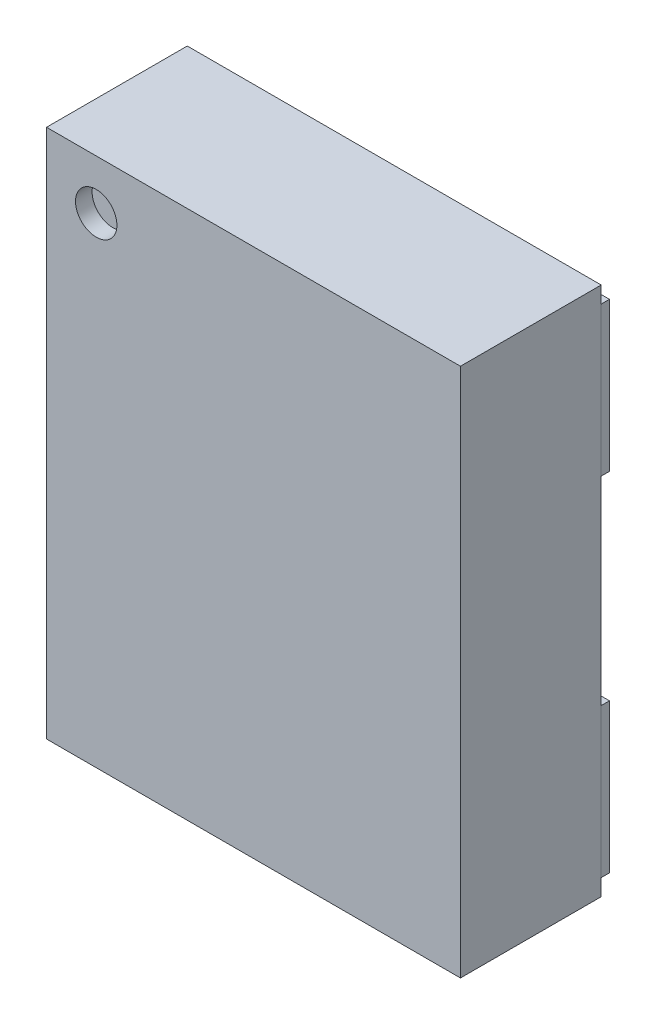
ISO-10303-21;
HEADER;
FILE_DESCRIPTION(('STEP AP214'),'2;1');
FILE_NAME('part.step','',(''),(''),'','','');
FILE_SCHEMA(('AUTOMOTIVE_DESIGN { 1 0 10303 214 1 1 1 1 }'));
ENDSEC;
DATA;
#1=APPLICATION_CONTEXT('core data for automotive mechanical design processes');
#2=APPLICATION_PROTOCOL_DEFINITION('international standard','automotive_design',2000,#1);
#3=PRODUCT_CONTEXT('',#1,'mechanical');
#4=PRODUCT('Part','Part','',(#3));
#5=PRODUCT_RELATED_PRODUCT_CATEGORY('part','',(#4));
#6=PRODUCT_DEFINITION_FORMATION('','',#4);
#7=PRODUCT_DEFINITION_CONTEXT('part definition',#1,'design');
#8=PRODUCT_DEFINITION('design','',#6,#7);
#9=PRODUCT_DEFINITION_SHAPE('','',#8);
#10=(LENGTH_UNIT() NAMED_UNIT(*) SI_UNIT(.MILLI.,.METRE.));
#11=(NAMED_UNIT(*) PLANE_ANGLE_UNIT() SI_UNIT($,.RADIAN.));
#12=(NAMED_UNIT(*) SI_UNIT($,.STERADIAN.) SOLID_ANGLE_UNIT());
#13=UNCERTAINTY_MEASURE_WITH_UNIT(LENGTH_MEASURE(1.E-05),#10,'distance_accuracy_value','');
#14=(GEOMETRIC_REPRESENTATION_CONTEXT(3) GLOBAL_UNCERTAINTY_ASSIGNED_CONTEXT((#13)) GLOBAL_UNIT_ASSIGNED_CONTEXT((#10,
#11,#12)) REPRESENTATION_CONTEXT('',''));
#15=CARTESIAN_POINT('',(0.,0.,0.));
#16=DIRECTION('',(0.,0.,1.));
#17=DIRECTION('',(1.,0.,0.));
#18=AXIS2_PLACEMENT_3D('',#15,#16,#17);
#19=CARTESIAN_POINT('',(0.,0.,0.));
#20=DIRECTION('',(0.,0.,-1.));
#21=DIRECTION('',(-1.,0.,0.));
#22=AXIS2_PLACEMENT_3D('',#19,#20,#21);
#23=PLANE('',#22);
#24=DIRECTION('',(1.,0.,0.));
#25=VECTOR('',#24,1.);
#26=CARTESIAN_POINT('',(1.25,1.5,0.));
#27=LINE('',#26,#25);
#28=CARTESIAN_POINT('',(0.44999999999994,1.5,0.));
#29=VERTEX_POINT('',#28);
#30=CARTESIAN_POINT('',(1.25,1.5,0.));
#31=VERTEX_POINT('',#30);
#32=EDGE_CURVE('P0_E79',#29,#31,#27,.T.);
#33=ORIENTED_EDGE('',*,*,#32,.F.);
#34=DIRECTION('',(0.,-1.,0.));
#35=VECTOR('',#34,1.);
#36=CARTESIAN_POINT('',(0.44999999999994,1.5,0.));
#37=LINE('',#36,#35);
#38=CARTESIAN_POINT('',(0.44999999999994,0.599999999999998,0.));
#39=VERTEX_POINT('',#38);
#40=EDGE_CURVE('P0_E55',#39,#29,#37,.F.);
#41=ORIENTED_EDGE('',*,*,#40,.F.);
#42=DIRECTION('',(1.,0.,0.));
#43=VECTOR('',#42,1.);
#44=CARTESIAN_POINT('',(1.25,0.599999999999998,0.));
#45=LINE('',#44,#43);
#46=CARTESIAN_POINT('',(1.25,0.599999999999998,0.));
#47=VERTEX_POINT('',#46);
#48=EDGE_CURVE('P0_E57',#47,#39,#45,.F.);
#49=ORIENTED_EDGE('',*,*,#48,.F.);
#50=DIRECTION('',(0.,1.,0.));
#51=VECTOR('',#50,1.);
#52=CARTESIAN_POINT('',(1.25,1.5,0.));
#53=LINE('',#52,#51);
#54=EDGE_CURVE('P0_E20',#31,#47,#53,.F.);
#55=ORIENTED_EDGE('',*,*,#54,.F.);
#56=EDGE_LOOP('',(#33,#41,#49,#55));
#57=FACE_BOUND('',#56,.T.);
#58=ADVANCED_FACE('P0_F17',(#57),#23,.F.);
#59=CARTESIAN_POINT('',(1.25,1.5,-0.05));
#60=DIRECTION('',(1.,0.,0.));
#61=DIRECTION('',(0.,1.,0.));
#62=AXIS2_PLACEMENT_3D('',#59,#60,#61);
#63=PLANE('',#62);
#64=DIRECTION('',(0.,1.,0.));
#65=VECTOR('',#64,1.);
#66=CARTESIAN_POINT('',(1.25,0.,-0.05));
#67=LINE('',#66,#65);
#68=CARTESIAN_POINT('',(1.25,1.5,-0.05));
#69=VERTEX_POINT('',#68);
#70=CARTESIAN_POINT('',(1.25,0.599999999999998,-0.05));
#71=VERTEX_POINT('',#70);
#72=EDGE_CURVE('P0_E83',#69,#71,#67,.F.);
#73=ORIENTED_EDGE('',*,*,#72,.F.);
#74=DIRECTION('',(0.,0.,1.));
#75=VECTOR('',#74,1.);
#76=CARTESIAN_POINT('',(1.25,1.5,-0.05));
#77=LINE('',#76,#75);
#78=EDGE_CURVE('P0_E68',#31,#69,#77,.F.);
#79=ORIENTED_EDGE('',*,*,#78,.F.);
#80=ORIENTED_EDGE('',*,*,#54,.T.);
#81=DIRECTION('',(0.,0.,1.));
#82=VECTOR('',#81,1.);
#83=CARTESIAN_POINT('',(1.25,0.599999999999998,-0.05));
#84=LINE('',#83,#82);
#85=EDGE_CURVE('P0_E63',#71,#47,#84,.T.);
#86=ORIENTED_EDGE('',*,*,#85,.F.);
#87=EDGE_LOOP('',(#73,#79,#80,#86));
#88=FACE_BOUND('',#87,.T.);
#89=ADVANCED_FACE('P0_F65',(#88),#63,.T.);
#90=CARTESIAN_POINT('',(1.25,0.599999999999998,-0.05));
#91=DIRECTION('',(0.,-1.,0.));
#92=DIRECTION('',(1.,0.,0.));
#93=AXIS2_PLACEMENT_3D('',#90,#91,#92);
#94=PLANE('',#93);
#95=DIRECTION('',(-1.,0.,0.));
#96=VECTOR('',#95,1.);
#97=CARTESIAN_POINT('',(0.,0.599999999999998,-0.05));
#98=LINE('',#97,#96);
#99=CARTESIAN_POINT('',(0.44999999999994,0.599999999999998,-0.05));
#100=VERTEX_POINT('',#99);
#101=EDGE_CURVE('P0_E72',#71,#100,#98,.T.);
#102=ORIENTED_EDGE('',*,*,#101,.F.);
#103=ORIENTED_EDGE('',*,*,#85,.T.);
#104=ORIENTED_EDGE('',*,*,#48,.T.);
#105=DIRECTION('',(0.,0.,1.));
#106=VECTOR('',#105,1.);
#107=CARTESIAN_POINT('',(0.44999999999994,0.599999999999998,-0.05));
#108=LINE('',#107,#106);
#109=EDGE_CURVE('P0_E75',#100,#39,#108,.T.);
#110=ORIENTED_EDGE('',*,*,#109,.F.);
#111=EDGE_LOOP('',(#102,#103,#104,#110));
#112=FACE_BOUND('',#111,.T.);
#113=ADVANCED_FACE('P0_F70',(#112),#94,.T.);
#114=CARTESIAN_POINT('',(0.44999999999994,1.5,-0.05));
#115=DIRECTION('',(-1.,0.,0.));
#116=DIRECTION('',(0.,-1.,0.));
#117=AXIS2_PLACEMENT_3D('',#114,#115,#116);
#118=PLANE('',#117);
#119=DIRECTION('',(0.,1.,0.));
#120=VECTOR('',#119,1.);
#121=CARTESIAN_POINT('',(0.44999999999994,0.,-0.05));
#122=LINE('',#121,#120);
#123=CARTESIAN_POINT('',(0.44999999999994,1.5,-0.05));
#124=VERTEX_POINT('',#123);
#125=EDGE_CURVE('P0_E26',#100,#124,#122,.T.);
#126=ORIENTED_EDGE('',*,*,#125,.F.);
#127=ORIENTED_EDGE('',*,*,#109,.T.);
#128=ORIENTED_EDGE('',*,*,#40,.T.);
#129=DIRECTION('',(0.,0.,1.));
#130=VECTOR('',#129,1.);
#131=CARTESIAN_POINT('',(0.44999999999994,1.5,-0.05));
#132=LINE('',#131,#130);
#133=EDGE_CURVE('P0_E35',#124,#29,#132,.T.);
#134=ORIENTED_EDGE('',*,*,#133,.F.);
#135=EDGE_LOOP('',(#126,#127,#128,#134));
#136=FACE_BOUND('',#135,.T.);
#137=ADVANCED_FACE('P0_F89',(#136),#118,.T.);
#138=CARTESIAN_POINT('',(1.25,1.5,-0.05));
#139=DIRECTION('',(0.,1.,0.));
#140=DIRECTION('',(0.,0.,1.));
#141=AXIS2_PLACEMENT_3D('',#138,#139,#140);
#142=PLANE('',#141);
#143=DIRECTION('',(-1.,0.,0.));
#144=VECTOR('',#143,1.);
#145=CARTESIAN_POINT('',(0.,1.5,-0.05));
#146=LINE('',#145,#144);
#147=EDGE_CURVE('P0_E11',#124,#69,#146,.F.);
#148=ORIENTED_EDGE('',*,*,#147,.F.);
#149=ORIENTED_EDGE('',*,*,#133,.T.);
#150=ORIENTED_EDGE('',*,*,#32,.T.);
#151=ORIENTED_EDGE('',*,*,#78,.T.);
#152=EDGE_LOOP('',(#148,#149,#150,#151));
#153=FACE_BOUND('',#152,.T.);
#154=ADVANCED_FACE('P0_F91',(#153),#142,.T.);
#155=CARTESIAN_POINT('',(0.,0.,-0.05));
#156=DIRECTION('',(0.,0.,-1.));
#157=DIRECTION('',(-1.,0.,0.));
#158=AXIS2_PLACEMENT_3D('',#155,#156,#157);
#159=PLANE('',#158);
#160=ORIENTED_EDGE('',*,*,#125,.T.);
#161=ORIENTED_EDGE('',*,*,#147,.T.);
#162=ORIENTED_EDGE('',*,*,#72,.T.);
#163=ORIENTED_EDGE('',*,*,#101,.T.);
#164=EDGE_LOOP('',(#160,#161,#162,#163));
#165=FACE_BOUND('',#164,.T.);
#166=ADVANCED_FACE('P0_F88',(#165),#159,.T.);
#167=CLOSED_SHELL('',(#58,#89,#113,#137,#154,#166));
#168=MANIFOLD_SOLID_BREP('P0_B1',#167);
#169=CARTESIAN_POINT('',(-0.95,1.3,0.75));
#170=DIRECTION('',(0.,0.,1.));
#171=DIRECTION('',(1.,0.,0.));
#172=AXIS2_PLACEMENT_3D('',#169,#170,#171);
#173=PLANE('',#172);
#174=CARTESIAN_POINT('',(-0.95,1.3,0.75));
#175=DIRECTION('',(0.,0.,1.));
#176=DIRECTION('',(1.,0.,0.));
#177=AXIS2_PLACEMENT_3D('',#174,#175,#176);
#178=CIRCLE('',#177,0.125);
#179=CARTESIAN_POINT('',(-0.825,1.3,0.75));
#180=VERTEX_POINT('',#179);
#181=EDGE_CURVE('P1_E20',#180,#180,#178,.T.);
#182=ORIENTED_EDGE('',*,*,#181,.T.);
#183=EDGE_LOOP('',(#182));
#184=FACE_BOUND('',#183,.T.);
#185=ADVANCED_FACE('P1_F17',(#184),#173,.T.);
#186=CARTESIAN_POINT('',(-0.95,1.3,0.75));
#187=DIRECTION('',(0.,0.,1.));
#188=DIRECTION('',(1.,0.,0.));
#189=AXIS2_PLACEMENT_3D('',#186,#187,#188);
#190=CYLINDRICAL_SURFACE('',#189,0.125);
#191=CARTESIAN_POINT('',(-0.95,1.3,0.85));
#192=DIRECTION('',(0.,0.,1.));
#193=DIRECTION('',(1.,0.,0.));
#194=AXIS2_PLACEMENT_3D('',#191,#192,#193);
#195=CIRCLE('',#194,0.125);
#196=CARTESIAN_POINT('',(-0.825,1.3,0.85));
#197=VERTEX_POINT('',#196);
#198=EDGE_CURVE('P1_E67',#197,#197,#195,.F.);
#199=ORIENTED_EDGE('',*,*,#198,.F.);
#200=EDGE_LOOP('',(#199));
#201=FACE_BOUND('',#200,.T.);
#202=ORIENTED_EDGE('',*,*,#181,.F.);
#203=EDGE_LOOP('',(#202));
#204=FACE_BOUND('',#203,.T.);
#205=ADVANCED_FACE('P1_F87',(#201,#204),#190,.F.);
#206=CARTESIAN_POINT('',(0.,0.,0.85));
#207=DIRECTION('',(0.,0.,1.));
#208=DIRECTION('',(1.,0.,0.));
#209=AXIS2_PLACEMENT_3D('',#206,#207,#208);
#210=PLANE('',#209);
#211=DIRECTION('',(0.,1.,0.));
#212=VECTOR('',#211,1.);
#213=CARTESIAN_POINT('',(-1.25,1.6,0.85));
#214=LINE('',#213,#212);
#215=CARTESIAN_POINT('',(-1.25,1.6,0.85));
#216=VERTEX_POINT('',#215);
#217=CARTESIAN_POINT('',(-1.25,-1.6,0.85));
#218=VERTEX_POINT('',#217);
#219=EDGE_CURVE('P1_E55',#216,#218,#214,.F.);
#220=ORIENTED_EDGE('',*,*,#219,.T.);
#221=DIRECTION('',(1.,0.,0.));
#222=VECTOR('',#221,1.);
#223=CARTESIAN_POINT('',(-1.25,-1.6,0.85));
#224=LINE('',#223,#222);
#225=CARTESIAN_POINT('',(1.25,-1.6,0.85));
#226=VERTEX_POINT('',#225);
#227=EDGE_CURVE('P1_E202',#218,#226,#224,.T.);
#228=ORIENTED_EDGE('',*,*,#227,.T.);
#229=DIRECTION('',(0.,-1.,0.));
#230=VECTOR('',#229,1.);
#231=CARTESIAN_POINT('',(1.25,1.6,0.85));
#232=LINE('',#231,#230);
#233=CARTESIAN_POINT('',(1.25,1.6,0.85));
#234=VERTEX_POINT('',#233);
#235=EDGE_CURVE('P1_E61',#226,#234,#232,.F.);
#236=ORIENTED_EDGE('',*,*,#235,.T.);
#237=DIRECTION('',(1.,0.,0.));
#238=VECTOR('',#237,1.);
#239=CARTESIAN_POINT('',(-1.25,1.6,0.85));
#240=LINE('',#239,#238);
#241=EDGE_CURVE('P1_E58',#234,#216,#240,.F.);
#242=ORIENTED_EDGE('',*,*,#241,.T.);
#243=EDGE_LOOP('',(#220,#228,#236,#242));
#244=FACE_BOUND('',#243,.T.);
#245=ORIENTED_EDGE('',*,*,#198,.T.);
#246=EDGE_LOOP('',(#245));
#247=FACE_BOUND('',#246,.T.);
#248=ADVANCED_FACE('P1_F59',(#244,#247),#210,.T.);
#249=CARTESIAN_POINT('',(-1.25,1.6,0.85));
#250=DIRECTION('',(0.,-1.,0.));
#251=DIRECTION('',(0.,0.,-1.));
#252=AXIS2_PLACEMENT_3D('',#249,#250,#251);
#253=PLANE('',#252);
#254=DIRECTION('',(0.,0.,1.));
#255=VECTOR('',#254,1.);
#256=CARTESIAN_POINT('',(-1.25,1.6,0.85));
#257=LINE('',#256,#255);
#258=CARTESIAN_POINT('',(-1.25,1.6,0.));
#259=VERTEX_POINT('',#258);
#260=EDGE_CURVE('P1_E66',#259,#216,#257,.T.);
#261=ORIENTED_EDGE('',*,*,#260,.T.);
#262=ORIENTED_EDGE('',*,*,#241,.F.);
#263=DIRECTION('',(0.,0.,1.));
#264=VECTOR('',#263,1.);
#265=CARTESIAN_POINT('',(1.25,1.6,0.85));
#266=LINE('',#265,#264);
#267=CARTESIAN_POINT('',(1.25,1.6,0.));
#268=VERTEX_POINT('',#267);
#269=EDGE_CURVE('P1_E204',#234,#268,#266,.F.);
#270=ORIENTED_EDGE('',*,*,#269,.T.);
#271=DIRECTION('',(1.,0.,0.));
#272=VECTOR('',#271,1.);
#273=CARTESIAN_POINT('',(0.,1.6,0.));
#274=LINE('',#273,#272);
#275=EDGE_CURVE('P1_E78',#268,#259,#274,.F.);
#276=ORIENTED_EDGE('',*,*,#275,.T.);
#277=EDGE_LOOP('',(#261,#262,#270,#276));
#278=FACE_BOUND('',#277,.T.);
#279=ADVANCED_FACE('P1_F77',(#278),#253,.F.);
#280=CARTESIAN_POINT('',(-1.25,1.6,0.85));
#281=DIRECTION('',(1.,0.,0.));
#282=DIRECTION('',(0.,1.,0.));
#283=AXIS2_PLACEMENT_3D('',#280,#281,#282);
#284=PLANE('',#283);
#285=DIRECTION('',(0.,0.,1.));
#286=VECTOR('',#285,1.);
#287=CARTESIAN_POINT('',(-1.25,-1.6,0.85));
#288=LINE('',#287,#286);
#289=CARTESIAN_POINT('',(-1.25,-1.6,0.));
#290=VERTEX_POINT('',#289);
#291=EDGE_CURVE('P1_E74',#290,#218,#288,.T.);
#292=ORIENTED_EDGE('',*,*,#291,.T.);
#293=ORIENTED_EDGE('',*,*,#219,.F.);
#294=ORIENTED_EDGE('',*,*,#260,.F.);
#295=DIRECTION('',(0.,1.,0.));
#296=VECTOR('',#295,1.);
#297=CARTESIAN_POINT('',(-1.25,0.,0.));
#298=LINE('',#297,#296);
#299=EDGE_CURVE('P1_E210',#259,#290,#298,.F.);
#300=ORIENTED_EDGE('',*,*,#299,.T.);
#301=EDGE_LOOP('',(#292,#293,#294,#300));
#302=FACE_BOUND('',#301,.T.);
#303=ADVANCED_FACE('P1_F71',(#302),#284,.F.);
#304=CARTESIAN_POINT('',(-1.25,-1.6,0.85));
#305=DIRECTION('',(0.,1.,0.));
#306=DIRECTION('',(0.,0.,1.));
#307=AXIS2_PLACEMENT_3D('',#304,#305,#306);
#308=PLANE('',#307);
#309=DIRECTION('',(0.,0.,1.));
#310=VECTOR('',#309,1.);
#311=CARTESIAN_POINT('',(1.25,-1.6,0.85));
#312=LINE('',#311,#310);
#313=CARTESIAN_POINT('',(1.25,-1.6,0.));
#314=VERTEX_POINT('',#313);
#315=EDGE_CURVE('P1_E34',#314,#226,#312,.T.);
#316=ORIENTED_EDGE('',*,*,#315,.T.);
#317=ORIENTED_EDGE('',*,*,#227,.F.);
#318=ORIENTED_EDGE('',*,*,#291,.F.);
#319=DIRECTION('',(1.,0.,0.));
#320=VECTOR('',#319,1.);
#321=CARTESIAN_POINT('',(0.,-1.6,0.));
#322=LINE('',#321,#320);
#323=EDGE_CURVE('P1_E26',#290,#314,#322,.T.);
#324=ORIENTED_EDGE('',*,*,#323,.T.);
#325=EDGE_LOOP('',(#316,#317,#318,#324));
#326=FACE_BOUND('',#325,.T.);
#327=ADVANCED_FACE('P1_F104',(#326),#308,.F.);
#328=CARTESIAN_POINT('',(1.25,1.6,0.85));
#329=DIRECTION('',(-1.,0.,0.));
#330=DIRECTION('',(0.,-1.,0.));
#331=AXIS2_PLACEMENT_3D('',#328,#329,#330);
#332=PLANE('',#331);
#333=ORIENTED_EDGE('',*,*,#269,.F.);
#334=ORIENTED_EDGE('',*,*,#235,.F.);
#335=ORIENTED_EDGE('',*,*,#315,.F.);
#336=DIRECTION('',(0.,1.,0.));
#337=VECTOR('',#336,1.);
#338=CARTESIAN_POINT('',(1.25,0.,0.));
#339=LINE('',#338,#337);
#340=EDGE_CURVE('P1_E11',#314,#268,#339,.T.);
#341=ORIENTED_EDGE('',*,*,#340,.T.);
#342=EDGE_LOOP('',(#333,#334,#335,#341));
#343=FACE_BOUND('',#342,.T.);
#344=ADVANCED_FACE('P1_F98',(#343),#332,.F.);
#345=CARTESIAN_POINT('',(0.,0.,0.));
#346=DIRECTION('',(0.,0.,1.));
#347=DIRECTION('',(1.,0.,0.));
#348=AXIS2_PLACEMENT_3D('',#345,#346,#347);
#349=PLANE('',#348);
#350=ORIENTED_EDGE('',*,*,#323,.F.);
#351=ORIENTED_EDGE('',*,*,#299,.F.);
#352=ORIENTED_EDGE('',*,*,#275,.F.);
#353=ORIENTED_EDGE('',*,*,#340,.F.);
#354=EDGE_LOOP('',(#350,#351,#352,#353));
#355=FACE_BOUND('',#354,.T.);
#356=ADVANCED_FACE('P1_F96',(#355),#349,.F.);
#357=CLOSED_SHELL('',(#185,#205,#248,#279,#303,#327,#344,#356));
#358=MANIFOLD_SOLID_BREP('P1_B1',#357);
#359=CARTESIAN_POINT('',(0.,0.,0.));
#360=DIRECTION('',(0.,0.,-1.));
#361=DIRECTION('',(-1.,0.,0.));
#362=AXIS2_PLACEMENT_3D('',#359,#360,#361);
#363=PLANE('',#362);
#364=DIRECTION('',(-1.,0.,0.));
#365=VECTOR('',#364,1.);
#366=CARTESIAN_POINT('',(-0.450000000000023,-0.599999999999961,0.));
#367=LINE('',#366,#365);
#368=CARTESIAN_POINT('',(-1.25000000000002,-0.599999999999961,0.));
#369=VERTEX_POINT('',#368);
#370=CARTESIAN_POINT('',(-0.450000000000023,-0.599999999999961,0.));
#371=VERTEX_POINT('',#370);
#372=EDGE_CURVE('P2_E79',#369,#371,#367,.F.);
#373=ORIENTED_EDGE('',*,*,#372,.F.);
#374=DIRECTION('',(0.,1.,0.));
#375=VECTOR('',#374,1.);
#376=CARTESIAN_POINT('',(-1.25000000000002,-0.599999999999961,0.));
#377=LINE('',#376,#375);
#378=CARTESIAN_POINT('',(-1.25000000000002,-1.49999999999996,0.));
#379=VERTEX_POINT('',#378);
#380=EDGE_CURVE('P2_E55',#379,#369,#377,.T.);
#381=ORIENTED_EDGE('',*,*,#380,.F.);
#382=DIRECTION('',(1.,0.,0.));
#383=VECTOR('',#382,1.);
#384=CARTESIAN_POINT('',(-0.450000000000023,-1.49999999999996,0.));
#385=LINE('',#384,#383);
#386=CARTESIAN_POINT('',(-0.450000000000023,-1.49999999999996,0.));
#387=VERTEX_POINT('',#386);
#388=EDGE_CURVE('P2_E57',#387,#379,#385,.F.);
#389=ORIENTED_EDGE('',*,*,#388,.F.);
#390=DIRECTION('',(0.,1.,0.));
#391=VECTOR('',#390,1.);
#392=CARTESIAN_POINT('',(-0.450000000000023,-0.599999999999961,0.));
#393=LINE('',#392,#391);
#394=EDGE_CURVE('P2_E20',#371,#387,#393,.F.);
#395=ORIENTED_EDGE('',*,*,#394,.F.);
#396=EDGE_LOOP('',(#373,#381,#389,#395));
#397=FACE_BOUND('',#396,.T.);
#398=ADVANCED_FACE('P2_F17',(#397),#363,.F.);
#399=CARTESIAN_POINT('',(-0.450000000000023,-0.599999999999961,-0.05));
#400=DIRECTION('',(1.,0.,0.));
#401=DIRECTION('',(0.,1.,0.));
#402=AXIS2_PLACEMENT_3D('',#399,#400,#401);
#403=PLANE('',#402);
#404=DIRECTION('',(0.,1.,0.));
#405=VECTOR('',#404,1.);
#406=CARTESIAN_POINT('',(-0.450000000000023,0.,-0.05));
#407=LINE('',#406,#405);
#408=CARTESIAN_POINT('',(-0.450000000000023,-0.599999999999961,-0.05));
#409=VERTEX_POINT('',#408);
#410=CARTESIAN_POINT('',(-0.450000000000023,-1.49999999999996,-0.05));
#411=VERTEX_POINT('',#410);
#412=EDGE_CURVE('P2_E83',#409,#411,#407,.F.);
#413=ORIENTED_EDGE('',*,*,#412,.F.);
#414=DIRECTION('',(0.,0.,1.));
#415=VECTOR('',#414,1.);
#416=CARTESIAN_POINT('',(-0.450000000000023,-0.599999999999961,-0.05));
#417=LINE('',#416,#415);
#418=EDGE_CURVE('P2_E68',#371,#409,#417,.F.);
#419=ORIENTED_EDGE('',*,*,#418,.F.);
#420=ORIENTED_EDGE('',*,*,#394,.T.);
#421=DIRECTION('',(0.,0.,-1.));
#422=VECTOR('',#421,1.);
#423=CARTESIAN_POINT('',(-0.450000000000023,-1.49999999999996,-0.05));
#424=LINE('',#423,#422);
#425=EDGE_CURVE('P2_E63',#411,#387,#424,.F.);
#426=ORIENTED_EDGE('',*,*,#425,.F.);
#427=EDGE_LOOP('',(#413,#419,#420,#426));
#428=FACE_BOUND('',#427,.T.);
#429=ADVANCED_FACE('P2_F65',(#428),#403,.T.);
#430=CARTESIAN_POINT('',(-0.450000000000023,-1.49999999999996,-0.05));
#431=DIRECTION('',(0.,-1.,0.));
#432=DIRECTION('',(0.,0.,-1.));
#433=AXIS2_PLACEMENT_3D('',#430,#431,#432);
#434=PLANE('',#433);
#435=DIRECTION('',(-1.,0.,0.));
#436=VECTOR('',#435,1.);
#437=CARTESIAN_POINT('',(0.,-1.49999999999996,-0.05));
#438=LINE('',#437,#436);
#439=CARTESIAN_POINT('',(-1.25000000000002,-1.49999999999996,-0.05));
#440=VERTEX_POINT('',#439);
#441=EDGE_CURVE('P2_E72',#411,#440,#438,.T.);
#442=ORIENTED_EDGE('',*,*,#441,.F.);
#443=ORIENTED_EDGE('',*,*,#425,.T.);
#444=ORIENTED_EDGE('',*,*,#388,.T.);
#445=DIRECTION('',(0.,0.,1.));
#446=VECTOR('',#445,1.);
#447=CARTESIAN_POINT('',(-1.25000000000002,-1.49999999999996,-0.05));
#448=LINE('',#447,#446);
#449=EDGE_CURVE('P2_E75',#440,#379,#448,.T.);
#450=ORIENTED_EDGE('',*,*,#449,.F.);
#451=EDGE_LOOP('',(#442,#443,#444,#450));
#452=FACE_BOUND('',#451,.T.);
#453=ADVANCED_FACE('P2_F70',(#452),#434,.T.);
#454=CARTESIAN_POINT('',(-1.25000000000002,-0.599999999999961,-0.05));
#455=DIRECTION('',(-1.,0.,0.));
#456=DIRECTION('',(0.,0.,1.));
#457=AXIS2_PLACEMENT_3D('',#454,#455,#456);
#458=PLANE('',#457);
#459=DIRECTION('',(0.,1.,0.));
#460=VECTOR('',#459,1.);
#461=CARTESIAN_POINT('',(-1.25000000000002,0.,-0.05));
#462=LINE('',#461,#460);
#463=CARTESIAN_POINT('',(-1.25000000000002,-0.599999999999961,-0.05));
#464=VERTEX_POINT('',#463);
#465=EDGE_CURVE('P2_E26',#440,#464,#462,.T.);
#466=ORIENTED_EDGE('',*,*,#465,.F.);
#467=ORIENTED_EDGE('',*,*,#449,.T.);
#468=ORIENTED_EDGE('',*,*,#380,.T.);
#469=DIRECTION('',(0.,0.,1.));
#470=VECTOR('',#469,1.);
#471=CARTESIAN_POINT('',(-1.25000000000002,-0.599999999999961,-0.05));
#472=LINE('',#471,#470);
#473=EDGE_CURVE('P2_E35',#464,#369,#472,.T.);
#474=ORIENTED_EDGE('',*,*,#473,.F.);
#475=EDGE_LOOP('',(#466,#467,#468,#474));
#476=FACE_BOUND('',#475,.T.);
#477=ADVANCED_FACE('P2_F89',(#476),#458,.T.);
#478=CARTESIAN_POINT('',(-0.450000000000023,-0.599999999999961,-0.05));
#479=DIRECTION('',(0.,1.,0.));
#480=DIRECTION('',(-1.,0.,0.));
#481=AXIS2_PLACEMENT_3D('',#478,#479,#480);
#482=PLANE('',#481);
#483=DIRECTION('',(-1.,0.,0.));
#484=VECTOR('',#483,1.);
#485=CARTESIAN_POINT('',(0.,-0.599999999999961,-0.05));
#486=LINE('',#485,#484);
#487=EDGE_CURVE('P2_E11',#464,#409,#486,.F.);
#488=ORIENTED_EDGE('',*,*,#487,.F.);
#489=ORIENTED_EDGE('',*,*,#473,.T.);
#490=ORIENTED_EDGE('',*,*,#372,.T.);
#491=ORIENTED_EDGE('',*,*,#418,.T.);
#492=EDGE_LOOP('',(#488,#489,#490,#491));
#493=FACE_BOUND('',#492,.T.);
#494=ADVANCED_FACE('P2_F91',(#493),#482,.T.);
#495=CARTESIAN_POINT('',(0.,0.,-0.05));
#496=DIRECTION('',(0.,0.,-1.));
#497=DIRECTION('',(-1.,0.,0.));
#498=AXIS2_PLACEMENT_3D('',#495,#496,#497);
#499=PLANE('',#498);
#500=ORIENTED_EDGE('',*,*,#465,.T.);
#501=ORIENTED_EDGE('',*,*,#487,.T.);
#502=ORIENTED_EDGE('',*,*,#412,.T.);
#503=ORIENTED_EDGE('',*,*,#441,.T.);
#504=EDGE_LOOP('',(#500,#501,#502,#503));
#505=FACE_BOUND('',#504,.T.);
#506=ADVANCED_FACE('P2_F88',(#505),#499,.T.);
#507=CLOSED_SHELL('',(#398,#429,#453,#477,#494,#506));
#508=MANIFOLD_SOLID_BREP('P2_B1',#507);
#509=CARTESIAN_POINT('',(0.,0.,0.));
#510=DIRECTION('',(0.,0.,-1.));
#511=DIRECTION('',(-1.,0.,0.));
#512=AXIS2_PLACEMENT_3D('',#509,#510,#511);
#513=PLANE('',#512);
#514=DIRECTION('',(1.,0.,0.));
#515=VECTOR('',#514,1.);
#516=CARTESIAN_POINT('',(1.24999999999998,-0.599999999999959,0.));
#517=LINE('',#516,#515);
#518=CARTESIAN_POINT('',(0.449999999999977,-0.599999999999959,0.));
#519=VERTEX_POINT('',#518);
#520=CARTESIAN_POINT('',(1.24999999999998,-0.599999999999959,0.));
#521=VERTEX_POINT('',#520);
#522=EDGE_CURVE('P3_E79',#519,#521,#517,.T.);
#523=ORIENTED_EDGE('',*,*,#522,.F.);
#524=DIRECTION('',(0.,-1.,0.));
#525=VECTOR('',#524,1.);
#526=CARTESIAN_POINT('',(0.449999999999977,-0.599999999999959,0.));
#527=LINE('',#526,#525);
#528=CARTESIAN_POINT('',(0.449999999999977,-1.49999999999996,0.));
#529=VERTEX_POINT('',#528);
#530=EDGE_CURVE('P3_E55',#529,#519,#527,.F.);
#531=ORIENTED_EDGE('',*,*,#530,.F.);
#532=DIRECTION('',(1.,0.,0.));
#533=VECTOR('',#532,1.);
#534=CARTESIAN_POINT('',(1.24999999999998,-1.49999999999996,0.));
#535=LINE('',#534,#533);
#536=CARTESIAN_POINT('',(1.24999999999998,-1.49999999999996,0.));
#537=VERTEX_POINT('',#536);
#538=EDGE_CURVE('P3_E57',#537,#529,#535,.F.);
#539=ORIENTED_EDGE('',*,*,#538,.F.);
#540=DIRECTION('',(0.,1.,0.));
#541=VECTOR('',#540,1.);
#542=CARTESIAN_POINT('',(1.24999999999998,-0.599999999999959,0.));
#543=LINE('',#542,#541);
#544=EDGE_CURVE('P3_E20',#521,#537,#543,.F.);
#545=ORIENTED_EDGE('',*,*,#544,.F.);
#546=EDGE_LOOP('',(#523,#531,#539,#545));
#547=FACE_BOUND('',#546,.T.);
#548=ADVANCED_FACE('P3_F17',(#547),#513,.F.);
#549=CARTESIAN_POINT('',(1.24999999999998,-0.599999999999959,-0.05));
#550=DIRECTION('',(1.,0.,0.));
#551=DIRECTION('',(0.,0.,-1.));
#552=AXIS2_PLACEMENT_3D('',#549,#550,#551);
#553=PLANE('',#552);
#554=DIRECTION('',(0.,1.,0.));
#555=VECTOR('',#554,1.);
#556=CARTESIAN_POINT('',(1.24999999999998,0.,-0.05));
#557=LINE('',#556,#555);
#558=CARTESIAN_POINT('',(1.24999999999998,-0.599999999999959,-0.05));
#559=VERTEX_POINT('',#558);
#560=CARTESIAN_POINT('',(1.24999999999998,-1.49999999999996,-0.05));
#561=VERTEX_POINT('',#560);
#562=EDGE_CURVE('P3_E83',#559,#561,#557,.F.);
#563=ORIENTED_EDGE('',*,*,#562,.F.);
#564=DIRECTION('',(0.,0.,1.));
#565=VECTOR('',#564,1.);
#566=CARTESIAN_POINT('',(1.24999999999998,-0.599999999999959,-0.05));
#567=LINE('',#566,#565);
#568=EDGE_CURVE('P3_E68',#521,#559,#567,.F.);
#569=ORIENTED_EDGE('',*,*,#568,.F.);
#570=ORIENTED_EDGE('',*,*,#544,.T.);
#571=DIRECTION('',(0.,0.,-1.));
#572=VECTOR('',#571,1.);
#573=CARTESIAN_POINT('',(1.24999999999998,-1.49999999999996,-0.05));
#574=LINE('',#573,#572);
#575=EDGE_CURVE('P3_E63',#561,#537,#574,.F.);
#576=ORIENTED_EDGE('',*,*,#575,.F.);
#577=EDGE_LOOP('',(#563,#569,#570,#576));
#578=FACE_BOUND('',#577,.T.);
#579=ADVANCED_FACE('P3_F65',(#578),#553,.T.);
#580=CARTESIAN_POINT('',(1.24999999999998,-1.49999999999996,-0.05));
#581=DIRECTION('',(0.,-1.,0.));
#582=DIRECTION('',(0.,0.,-1.));
#583=AXIS2_PLACEMENT_3D('',#580,#581,#582);
#584=PLANE('',#583);
#585=DIRECTION('',(-1.,0.,0.));
#586=VECTOR('',#585,1.);
#587=CARTESIAN_POINT('',(0.,-1.49999999999996,-0.05));
#588=LINE('',#587,#586);
#589=CARTESIAN_POINT('',(0.449999999999977,-1.49999999999996,-0.05));
#590=VERTEX_POINT('',#589);
#591=EDGE_CURVE('P3_E72',#561,#590,#588,.T.);
#592=ORIENTED_EDGE('',*,*,#591,.F.);
#593=ORIENTED_EDGE('',*,*,#575,.T.);
#594=ORIENTED_EDGE('',*,*,#538,.T.);
#595=DIRECTION('',(0.,0.,1.));
#596=VECTOR('',#595,1.);
#597=CARTESIAN_POINT('',(0.449999999999977,-1.49999999999996,-0.05));
#598=LINE('',#597,#596);
#599=EDGE_CURVE('P3_E75',#590,#529,#598,.T.);
#600=ORIENTED_EDGE('',*,*,#599,.F.);
#601=EDGE_LOOP('',(#592,#593,#594,#600));
#602=FACE_BOUND('',#601,.T.);
#603=ADVANCED_FACE('P3_F70',(#602),#584,.T.);
#604=CARTESIAN_POINT('',(0.449999999999977,-0.599999999999959,-0.05));
#605=DIRECTION('',(-1.,0.,0.));
#606=DIRECTION('',(0.,-1.,0.));
#607=AXIS2_PLACEMENT_3D('',#604,#605,#606);
#608=PLANE('',#607);
#609=DIRECTION('',(0.,1.,0.));
#610=VECTOR('',#609,1.);
#611=CARTESIAN_POINT('',(0.449999999999977,0.,-0.05));
#612=LINE('',#611,#610);
#613=CARTESIAN_POINT('',(0.449999999999977,-0.599999999999959,-0.05));
#614=VERTEX_POINT('',#613);
#615=EDGE_CURVE('P3_E26',#590,#614,#612,.T.);
#616=ORIENTED_EDGE('',*,*,#615,.F.);
#617=ORIENTED_EDGE('',*,*,#599,.T.);
#618=ORIENTED_EDGE('',*,*,#530,.T.);
#619=DIRECTION('',(0.,0.,1.));
#620=VECTOR('',#619,1.);
#621=CARTESIAN_POINT('',(0.449999999999977,-0.599999999999959,-0.05));
#622=LINE('',#621,#620);
#623=EDGE_CURVE('P3_E35',#614,#519,#622,.T.);
#624=ORIENTED_EDGE('',*,*,#623,.F.);
#625=EDGE_LOOP('',(#616,#617,#618,#624));
#626=FACE_BOUND('',#625,.T.);
#627=ADVANCED_FACE('P3_F89',(#626),#608,.T.);
#628=CARTESIAN_POINT('',(1.24999999999998,-0.599999999999959,-0.05));
#629=DIRECTION('',(0.,1.,0.));
#630=DIRECTION('',(0.,0.,1.));
#631=AXIS2_PLACEMENT_3D('',#628,#629,#630);
#632=PLANE('',#631);
#633=DIRECTION('',(-1.,0.,0.));
#634=VECTOR('',#633,1.);
#635=CARTESIAN_POINT('',(0.,-0.599999999999959,-0.05));
#636=LINE('',#635,#634);
#637=EDGE_CURVE('P3_E11',#614,#559,#636,.F.);
#638=ORIENTED_EDGE('',*,*,#637,.F.);
#639=ORIENTED_EDGE('',*,*,#623,.T.);
#640=ORIENTED_EDGE('',*,*,#522,.T.);
#641=ORIENTED_EDGE('',*,*,#568,.T.);
#642=EDGE_LOOP('',(#638,#639,#640,#641));
#643=FACE_BOUND('',#642,.T.);
#644=ADVANCED_FACE('P3_F91',(#643),#632,.T.);
#645=CARTESIAN_POINT('',(0.,0.,-0.05));
#646=DIRECTION('',(0.,0.,-1.));
#647=DIRECTION('',(-1.,0.,0.));
#648=AXIS2_PLACEMENT_3D('',#645,#646,#647);
#649=PLANE('',#648);
#650=ORIENTED_EDGE('',*,*,#615,.T.);
#651=ORIENTED_EDGE('',*,*,#637,.T.);
#652=ORIENTED_EDGE('',*,*,#562,.T.);
#653=ORIENTED_EDGE('',*,*,#591,.T.);
#654=EDGE_LOOP('',(#650,#651,#652,#653));
#655=FACE_BOUND('',#654,.T.);
#656=ADVANCED_FACE('P3_F88',(#655),#649,.T.);
#657=CLOSED_SHELL('',(#548,#579,#603,#627,#644,#656));
#658=MANIFOLD_SOLID_BREP('P3_B1',#657);
#659=CARTESIAN_POINT('',(0.,0.,0.));
#660=DIRECTION('',(0.,0.,1.));
#661=DIRECTION('',(1.,0.,0.));
#662=AXIS2_PLACEMENT_3D('',#659,#660,#661);
#663=PLANE('',#662);
#664=DIRECTION('',(1.,0.,0.));
#665=VECTOR('',#664,1.);
#666=CARTESIAN_POINT('',(-0.699999999999959,1.5,0.));
#667=LINE('',#666,#665);
#668=CARTESIAN_POINT('',(-1.25000000000004,1.5,0.));
#669=VERTEX_POINT('',#668);
#670=CARTESIAN_POINT('',(-0.699999999999959,1.5,0.));
#671=VERTEX_POINT('',#670);
#672=EDGE_CURVE('P4_E59',#669,#671,#667,.T.);
#673=ORIENTED_EDGE('',*,*,#672,.F.);
#674=DIRECTION('',(0.,1.,0.));
#675=VECTOR('',#674,1.);
#676=CARTESIAN_POINT('',(-1.25000000000004,1.5,0.));
#677=LINE('',#676,#675);
#678=CARTESIAN_POINT('',(-1.25000000000004,0.599999999999998,0.));
#679=VERTEX_POINT('',#678);
#680=EDGE_CURVE('P4_E86',#679,#669,#677,.T.);
#681=ORIENTED_EDGE('',*,*,#680,.F.);
#682=DIRECTION('',(1.,0.,0.));
#683=VECTOR('',#682,1.);
#684=CARTESIAN_POINT('',(-0.449999999999959,0.599999999999998,0.));
#685=LINE('',#684,#683);
#686=CARTESIAN_POINT('',(-0.449999999999959,0.599999999999998,0.));
#687=VERTEX_POINT('',#686);
#688=EDGE_CURVE('P4_E75',#687,#679,#685,.F.);
#689=ORIENTED_EDGE('',*,*,#688,.F.);
#690=DIRECTION('',(0.,1.,0.));
#691=VECTOR('',#690,1.);
#692=CARTESIAN_POINT('',(-0.449999999999959,1.25,0.));
#693=LINE('',#692,#691);
#694=CARTESIAN_POINT('',(-0.449999999999959,1.25,0.));
#695=VERTEX_POINT('',#694);
#696=EDGE_CURVE('P4_E19',#695,#687,#693,.F.);
#697=ORIENTED_EDGE('',*,*,#696,.F.);
#698=DIRECTION('',(-0.707106781186548,0.707106781186547,0.));
#699=VECTOR('',#698,1.);
#700=CARTESIAN_POINT('',(-0.699999999999959,1.5,0.));
#701=LINE('',#700,#699);
#702=EDGE_CURVE('P4_E64',#671,#695,#701,.F.);
#703=ORIENTED_EDGE('',*,*,#702,.F.);
#704=EDGE_LOOP('',(#673,#681,#689,#697,#703));
#705=FACE_BOUND('',#704,.T.);
#706=ADVANCED_FACE('P4_F16',(#705),#663,.T.);
#707=CARTESIAN_POINT('',(-0.449999999999959,1.25,-0.05));
#708=DIRECTION('',(1.,0.,0.));
#709=DIRECTION('',(0.,1.,0.));
#710=AXIS2_PLACEMENT_3D('',#707,#708,#709);
#711=PLANE('',#710);
#712=DIRECTION('',(0.,1.,0.));
#713=VECTOR('',#712,1.);
#714=CARTESIAN_POINT('',(-0.449999999999959,0.,-0.05));
#715=LINE('',#714,#713);
#716=CARTESIAN_POINT('',(-0.449999999999959,0.599999999999998,-0.05));
#717=VERTEX_POINT('',#716);
#718=CARTESIAN_POINT('',(-0.449999999999959,1.25,-0.05));
#719=VERTEX_POINT('',#718);
#720=EDGE_CURVE('P4_E81',#717,#719,#715,.T.);
#721=ORIENTED_EDGE('',*,*,#720,.T.);
#722=DIRECTION('',(0.,0.,1.));
#723=VECTOR('',#722,1.);
#724=CARTESIAN_POINT('',(-0.449999999999959,1.25,-0.05));
#725=LINE('',#724,#723);
#726=EDGE_CURVE('P4_E69',#695,#719,#725,.F.);
#727=ORIENTED_EDGE('',*,*,#726,.F.);
#728=ORIENTED_EDGE('',*,*,#696,.T.);
#729=DIRECTION('',(0.,0.,1.));
#730=VECTOR('',#729,1.);
#731=CARTESIAN_POINT('',(-0.449999999999959,0.599999999999998,-0.05));
#732=LINE('',#731,#730);
#733=EDGE_CURVE('P4_E92',#717,#687,#732,.T.);
#734=ORIENTED_EDGE('',*,*,#733,.F.);
#735=EDGE_LOOP('',(#721,#727,#728,#734));
#736=FACE_BOUND('',#735,.T.);
#737=ADVANCED_FACE('P4_F80',(#736),#711,.T.);
#738=CARTESIAN_POINT('',(-0.699999999999959,1.5,-0.05));
#739=DIRECTION('',(0.707106781186547,0.707106781186548,0.));
#740=DIRECTION('',(-0.707106781186548,0.707106781186547,0.));
#741=AXIS2_PLACEMENT_3D('',#738,#739,#740);
#742=PLANE('',#741);
#743=DIRECTION('',(-0.707106781186548,0.707106781186547,0.));
#744=VECTOR('',#743,1.);
#745=CARTESIAN_POINT('',(-0.449999999999959,1.25,-0.05));
#746=LINE('',#745,#744);
#747=CARTESIAN_POINT('',(-0.699999999999959,1.5,-0.05));
#748=VERTEX_POINT('',#747);
#749=EDGE_CURVE('P4_E95',#719,#748,#746,.T.);
#750=ORIENTED_EDGE('',*,*,#749,.T.);
#751=DIRECTION('',(0.,0.,1.));
#752=VECTOR('',#751,1.);
#753=CARTESIAN_POINT('',(-0.699999999999959,1.5,-0.05));
#754=LINE('',#753,#752);
#755=EDGE_CURVE('P4_E71',#671,#748,#754,.F.);
#756=ORIENTED_EDGE('',*,*,#755,.F.);
#757=ORIENTED_EDGE('',*,*,#702,.T.);
#758=ORIENTED_EDGE('',*,*,#726,.T.);
#759=EDGE_LOOP('',(#750,#756,#757,#758));
#760=FACE_BOUND('',#759,.T.);
#761=ADVANCED_FACE('P4_F67',(#760),#742,.T.);
#762=CARTESIAN_POINT('',(-0.699999999999959,1.5,-0.05));
#763=DIRECTION('',(0.,1.,0.));
#764=DIRECTION('',(0.,0.,1.));
#765=AXIS2_PLACEMENT_3D('',#762,#763,#764);
#766=PLANE('',#765);
#767=DIRECTION('',(1.,0.,0.));
#768=VECTOR('',#767,1.);
#769=CARTESIAN_POINT('',(0.,1.5,-0.05));
#770=LINE('',#769,#768);
#771=CARTESIAN_POINT('',(-1.25000000000004,1.5,-0.05));
#772=VERTEX_POINT('',#771);
#773=EDGE_CURVE('P4_E97',#748,#772,#770,.F.);
#774=ORIENTED_EDGE('',*,*,#773,.T.);
#775=DIRECTION('',(0.,0.,1.));
#776=VECTOR('',#775,1.);
#777=CARTESIAN_POINT('',(-1.25000000000004,1.5,-0.05));
#778=LINE('',#777,#776);
#779=EDGE_CURVE('P4_E88',#669,#772,#778,.F.);
#780=ORIENTED_EDGE('',*,*,#779,.F.);
#781=ORIENTED_EDGE('',*,*,#672,.T.);
#782=ORIENTED_EDGE('',*,*,#755,.T.);
#783=EDGE_LOOP('',(#774,#780,#781,#782));
#784=FACE_BOUND('',#783,.T.);
#785=ADVANCED_FACE('P4_F107',(#784),#766,.T.);
#786=CARTESIAN_POINT('',(-1.25000000000004,1.5,-0.05));
#787=DIRECTION('',(-1.,0.,0.));
#788=DIRECTION('',(0.,0.,1.));
#789=AXIS2_PLACEMENT_3D('',#786,#787,#788);
#790=PLANE('',#789);
#791=DIRECTION('',(0.,1.,0.));
#792=VECTOR('',#791,1.);
#793=CARTESIAN_POINT('',(-1.25000000000004,0.,-0.05));
#794=LINE('',#793,#792);
#795=CARTESIAN_POINT('',(-1.25000000000004,0.599999999999998,-0.05));
#796=VERTEX_POINT('',#795);
#797=EDGE_CURVE('P4_E25',#772,#796,#794,.F.);
#798=ORIENTED_EDGE('',*,*,#797,.T.);
#799=DIRECTION('',(0.,0.,1.));
#800=VECTOR('',#799,1.);
#801=CARTESIAN_POINT('',(-1.25000000000004,0.599999999999998,-0.05));
#802=LINE('',#801,#800);
#803=EDGE_CURVE('P4_E33',#679,#796,#802,.F.);
#804=ORIENTED_EDGE('',*,*,#803,.F.);
#805=ORIENTED_EDGE('',*,*,#680,.T.);
#806=ORIENTED_EDGE('',*,*,#779,.T.);
#807=EDGE_LOOP('',(#798,#804,#805,#806));
#808=FACE_BOUND('',#807,.T.);
#809=ADVANCED_FACE('P4_F103',(#808),#790,.T.);
#810=CARTESIAN_POINT('',(-0.449999999999959,0.599999999999998,-0.05));
#811=DIRECTION('',(0.,-1.,0.));
#812=DIRECTION('',(1.,0.,0.));
#813=AXIS2_PLACEMENT_3D('',#810,#811,#812);
#814=PLANE('',#813);
#815=DIRECTION('',(1.,0.,0.));
#816=VECTOR('',#815,1.);
#817=CARTESIAN_POINT('',(0.,0.599999999999998,-0.05));
#818=LINE('',#817,#816);
#819=EDGE_CURVE('P4_E10',#796,#717,#818,.T.);
#820=ORIENTED_EDGE('',*,*,#819,.T.);
#821=ORIENTED_EDGE('',*,*,#733,.T.);
#822=ORIENTED_EDGE('',*,*,#688,.T.);
#823=ORIENTED_EDGE('',*,*,#803,.T.);
#824=EDGE_LOOP('',(#820,#821,#822,#823));
#825=FACE_BOUND('',#824,.T.);
#826=ADVANCED_FACE('P4_F115',(#825),#814,.T.);
#827=CARTESIAN_POINT('',(0.,0.,-0.05));
#828=DIRECTION('',(0.,0.,1.));
#829=DIRECTION('',(1.,0.,0.));
#830=AXIS2_PLACEMENT_3D('',#827,#828,#829);
#831=PLANE('',#830);
#832=ORIENTED_EDGE('',*,*,#797,.F.);
#833=ORIENTED_EDGE('',*,*,#773,.F.);
#834=ORIENTED_EDGE('',*,*,#749,.F.);
#835=ORIENTED_EDGE('',*,*,#720,.F.);
#836=ORIENTED_EDGE('',*,*,#819,.F.);
#837=EDGE_LOOP('',(#832,#833,#834,#835,#836));
#838=FACE_BOUND('',#837,.T.);
#839=ADVANCED_FACE('P4_F106',(#838),#831,.F.);
#840=CLOSED_SHELL('',(#706,#737,#761,#785,#809,#826,#839));
#841=MANIFOLD_SOLID_BREP('P4_B1',#840);
#842=ADVANCED_BREP_SHAPE_REPRESENTATION('',(#18,#168,#358,#508,#658,#841),#14);
#843=SHAPE_DEFINITION_REPRESENTATION(#9,#842);
ENDSEC;
END-ISO-10303-21;
